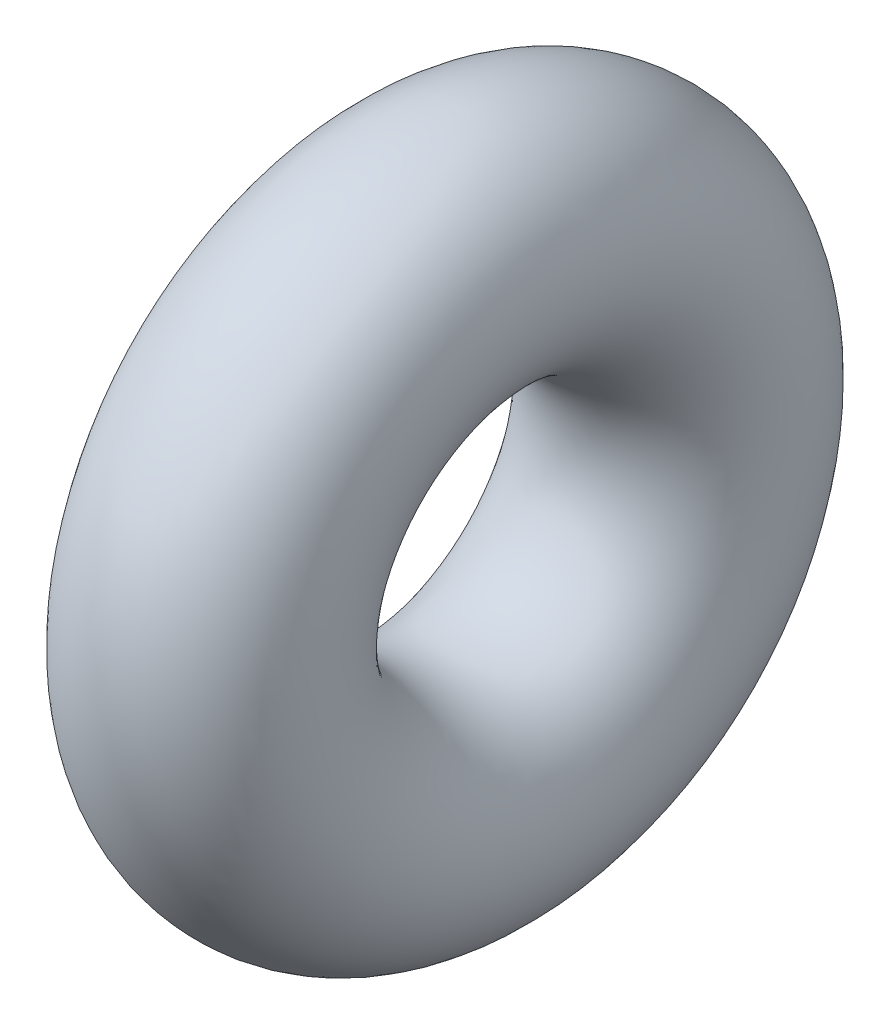
ISO-10303-21;
HEADER;
FILE_DESCRIPTION(('STEP AP214'),'2;1');
FILE_NAME('part.step','',(''),(''),'','','');
FILE_SCHEMA(('AUTOMOTIVE_DESIGN { 1 0 10303 214 1 1 1 1 }'));
ENDSEC;
DATA;
#1=APPLICATION_CONTEXT('core data for automotive mechanical design processes');
#2=APPLICATION_PROTOCOL_DEFINITION('international standard','automotive_design',2000,#1);
#3=PRODUCT_CONTEXT('',#1,'mechanical');
#4=PRODUCT('Part','Part','',(#3));
#5=PRODUCT_RELATED_PRODUCT_CATEGORY('part','',(#4));
#6=PRODUCT_DEFINITION_FORMATION('','',#4);
#7=PRODUCT_DEFINITION_CONTEXT('part definition',#1,'design');
#8=PRODUCT_DEFINITION('design','',#6,#7);
#9=PRODUCT_DEFINITION_SHAPE('','',#8);
#10=(LENGTH_UNIT() NAMED_UNIT(*) SI_UNIT(.MILLI.,.METRE.));
#11=(NAMED_UNIT(*) PLANE_ANGLE_UNIT() SI_UNIT($,.RADIAN.));
#12=(NAMED_UNIT(*) SI_UNIT($,.STERADIAN.) SOLID_ANGLE_UNIT());
#13=UNCERTAINTY_MEASURE_WITH_UNIT(LENGTH_MEASURE(1.E-05),#10,'distance_accuracy_value','');
#14=(GEOMETRIC_REPRESENTATION_CONTEXT(3) GLOBAL_UNCERTAINTY_ASSIGNED_CONTEXT((#13)) GLOBAL_UNIT_ASSIGNED_CONTEXT((#10,
#11,#12)) REPRESENTATION_CONTEXT('',''));
#15=CARTESIAN_POINT('',(0.,0.,0.));
#16=DIRECTION('',(0.,0.,1.));
#17=DIRECTION('',(1.,0.,0.));
#18=AXIS2_PLACEMENT_3D('',#15,#16,#17);
#19=CARTESIAN_POINT('',(0.,-3.8,2.4));
#20=DIRECTION('',(1.,0.,0.));
#21=DIRECTION('',(0.,0.,-1.));
#22=AXIS2_PLACEMENT_3D('',#19,#20,#21);
#23=TOROIDAL_SURFACE('',#22,0.2,0.1);
#24=ADVANCED_FACE('F14',(),#23,.T.);
#25=CLOSED_SHELL('',(#24));
#26=MANIFOLD_SOLID_BREP('B1',#25);
#27=ADVANCED_BREP_SHAPE_REPRESENTATION('',(#18,#26),#14);
#28=SHAPE_DEFINITION_REPRESENTATION(#9,#27);
ENDSEC;
END-ISO-10303-21;
